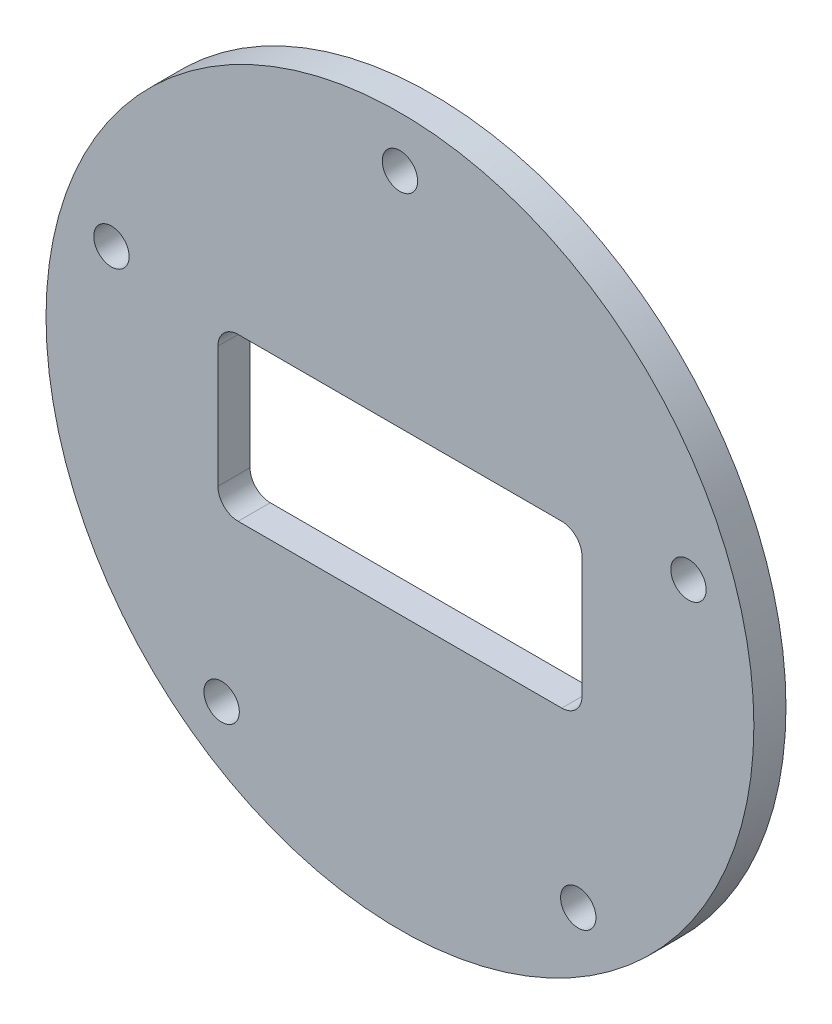
ISO-10303-21;
HEADER;
FILE_DESCRIPTION(('STEP AP214'),'2;1');
FILE_NAME('part.step','',(''),(''),'','','');
FILE_SCHEMA(('AUTOMOTIVE_DESIGN { 1 0 10303 214 1 1 1 1 }'));
ENDSEC;
DATA;
#1=APPLICATION_CONTEXT('core data for automotive mechanical design processes');
#2=APPLICATION_PROTOCOL_DEFINITION('international standard','automotive_design',2000,#1);
#3=PRODUCT_CONTEXT('',#1,'mechanical');
#4=PRODUCT('Part','Part','',(#3));
#5=PRODUCT_RELATED_PRODUCT_CATEGORY('part','',(#4));
#6=PRODUCT_DEFINITION_FORMATION('','',#4);
#7=PRODUCT_DEFINITION_CONTEXT('part definition',#1,'design');
#8=PRODUCT_DEFINITION('design','',#6,#7);
#9=PRODUCT_DEFINITION_SHAPE('','',#8);
#10=(LENGTH_UNIT() NAMED_UNIT(*) SI_UNIT(.MILLI.,.METRE.));
#11=(NAMED_UNIT(*) PLANE_ANGLE_UNIT() SI_UNIT($,.RADIAN.));
#12=(NAMED_UNIT(*) SI_UNIT($,.STERADIAN.) SOLID_ANGLE_UNIT());
#13=UNCERTAINTY_MEASURE_WITH_UNIT(LENGTH_MEASURE(1.E-05),#10,'distance_accuracy_value','');
#14=(GEOMETRIC_REPRESENTATION_CONTEXT(3) GLOBAL_UNCERTAINTY_ASSIGNED_CONTEXT((#13)) GLOBAL_UNIT_ASSIGNED_CONTEXT((#10,
#11,#12)) REPRESENTATION_CONTEXT('',''));
#15=CARTESIAN_POINT('',(0.,0.,0.));
#16=DIRECTION('',(0.,0.,1.));
#17=DIRECTION('',(1.,0.,0.));
#18=AXIS2_PLACEMENT_3D('',#15,#16,#17);
#19=CARTESIAN_POINT('',(0.,0.,3.175));
#20=DIRECTION('',(0.,0.,1.));
#21=DIRECTION('',(1.,0.,0.));
#22=AXIS2_PLACEMENT_3D('',#19,#20,#21);
#23=PLANE('',#22);
#24=CARTESIAN_POINT('',(-17.6335575687719,-24.2705098312492,3.175));
#25=DIRECTION('',(0.,0.,1.));
#26=DIRECTION('',(1.,0.,0.));
#27=AXIS2_PLACEMENT_3D('',#24,#25,#26);
#28=CIRCLE('',#27,1.75000000000268);
#29=CARTESIAN_POINT('',(-15.8835575687692,-24.2705098312492,3.175));
#30=VERTEX_POINT('',#29);
#31=EDGE_CURVE('E320',#30,#30,#28,.T.);
#32=ORIENTED_EDGE('',*,*,#31,.F.);
#33=EDGE_LOOP('',(#32));
#34=FACE_BOUND('',#33,.T.);
#35=CARTESIAN_POINT('',(28.5316954888555,9.27050983124964,3.175));
#36=DIRECTION('',(0.,0.,1.));
#37=DIRECTION('',(1.,0.,0.));
#38=AXIS2_PLACEMENT_3D('',#35,#36,#37);
#39=CIRCLE('',#38,1.75000000000057);
#40=CARTESIAN_POINT('',(30.2816954888561,9.27050983124964,3.175));
#41=VERTEX_POINT('',#40);
#42=EDGE_CURVE('E332',#41,#41,#39,.T.);
#43=ORIENTED_EDGE('',*,*,#42,.F.);
#44=EDGE_LOOP('',(#43));
#45=FACE_BOUND('',#44,.T.);
#46=DIRECTION('',(-1.,0.,0.));
#47=VECTOR('',#46,1.);
#48=CARTESIAN_POINT('',(16.,8.,3.175));
#49=LINE('',#48,#47);
#50=CARTESIAN_POINT('',(16.,8.,3.175));
#51=VERTEX_POINT('',#50);
#52=CARTESIAN_POINT('',(-16.,7.99999999999999,3.175));
#53=VERTEX_POINT('',#52);
#54=EDGE_CURVE('E106',#51,#53,#49,.T.);
#55=ORIENTED_EDGE('',*,*,#54,.F.);
#56=CARTESIAN_POINT('',(16.,6.,3.175));
#57=DIRECTION('',(0.,0.,1.));
#58=DIRECTION('',(1.,0.,0.));
#59=AXIS2_PLACEMENT_3D('',#56,#57,#58);
#60=CIRCLE('',#59,2.);
#61=CARTESIAN_POINT('',(18.,6.,3.175));
#62=VERTEX_POINT('',#61);
#63=EDGE_CURVE('E98',#62,#51,#60,.T.);
#64=ORIENTED_EDGE('',*,*,#63,.F.);
#65=DIRECTION('',(0.,1.,0.));
#66=VECTOR('',#65,1.);
#67=CARTESIAN_POINT('',(18.,-6.,3.175));
#68=LINE('',#67,#66);
#69=CARTESIAN_POINT('',(18.,-6.,3.175));
#70=VERTEX_POINT('',#69);
#71=EDGE_CURVE('E132',#70,#62,#68,.T.);
#72=ORIENTED_EDGE('',*,*,#71,.F.);
#73=CARTESIAN_POINT('',(16.,-6.,3.175));
#74=DIRECTION('',(0.,0.,1.));
#75=DIRECTION('',(1.,0.,0.));
#76=AXIS2_PLACEMENT_3D('',#73,#74,#75);
#77=CIRCLE('',#76,2.);
#78=CARTESIAN_POINT('',(16.,-8.,3.175));
#79=VERTEX_POINT('',#78);
#80=EDGE_CURVE('E130',#79,#70,#77,.T.);
#81=ORIENTED_EDGE('',*,*,#80,.F.);
#82=DIRECTION('',(1.,0.,0.));
#83=VECTOR('',#82,1.);
#84=CARTESIAN_POINT('',(16.,-8.,3.175));
#85=LINE('',#84,#83);
#86=CARTESIAN_POINT('',(-16.,-8.,3.175));
#87=VERTEX_POINT('',#86);
#88=EDGE_CURVE('E128',#87,#79,#85,.T.);
#89=ORIENTED_EDGE('',*,*,#88,.F.);
#90=CARTESIAN_POINT('',(-16.,-6.,3.175));
#91=DIRECTION('',(0.,0.,1.));
#92=DIRECTION('',(1.,0.,0.));
#93=AXIS2_PLACEMENT_3D('',#90,#91,#92);
#94=CIRCLE('',#93,2.);
#95=CARTESIAN_POINT('',(-18.,-6.,3.175));
#96=VERTEX_POINT('',#95);
#97=EDGE_CURVE('E126',#96,#87,#94,.T.);
#98=ORIENTED_EDGE('',*,*,#97,.F.);
#99=DIRECTION('',(0.,-1.,0.));
#100=VECTOR('',#99,1.);
#101=CARTESIAN_POINT('',(-18.,-6.,3.175));
#102=LINE('',#101,#100);
#103=CARTESIAN_POINT('',(-18.,6.,3.175));
#104=VERTEX_POINT('',#103);
#105=EDGE_CURVE('E121',#104,#96,#102,.T.);
#106=ORIENTED_EDGE('',*,*,#105,.F.);
#107=CARTESIAN_POINT('',(-16.,6.,3.175));
#108=DIRECTION('',(0.,0.,1.));
#109=DIRECTION('',(1.,0.,0.));
#110=AXIS2_PLACEMENT_3D('',#107,#108,#109);
#111=CIRCLE('',#110,2.);
#112=EDGE_CURVE('E119',#53,#104,#111,.T.);
#113=ORIENTED_EDGE('',*,*,#112,.F.);
#114=EDGE_LOOP('',(#55,#64,#72,#81,#89,#98,#106,#113));
#115=FACE_BOUND('',#114,.T.);
#116=CARTESIAN_POINT('',(0.,0.,3.175));
#117=DIRECTION('',(0.,0.,1.));
#118=DIRECTION('',(1.,0.,0.));
#119=AXIS2_PLACEMENT_3D('',#116,#117,#118);
#120=CIRCLE('',#119,35.);
#121=CARTESIAN_POINT('',(35.,0.,3.175));
#122=VERTEX_POINT('',#121);
#123=EDGE_CURVE('E11',#122,#122,#120,.T.);
#124=ORIENTED_EDGE('',*,*,#123,.T.);
#125=EDGE_LOOP('',(#124));
#126=FACE_BOUND('',#125,.T.);
#127=CARTESIAN_POINT('',(0.,30.,3.175));
#128=DIRECTION('',(0.,0.,1.));
#129=DIRECTION('',(1.,0.,0.));
#130=AXIS2_PLACEMENT_3D('',#127,#128,#129);
#131=CIRCLE('',#130,1.75);
#132=CARTESIAN_POINT('',(1.75,30.,3.175));
#133=VERTEX_POINT('',#132);
#134=EDGE_CURVE('E135',#133,#133,#131,.T.);
#135=ORIENTED_EDGE('',*,*,#134,.F.);
#136=EDGE_LOOP('',(#135));
#137=FACE_BOUND('',#136,.T.);
#138=CARTESIAN_POINT('',(17.6335575687765,-24.2705098312477,3.175));
#139=DIRECTION('',(0.,0.,1.));
#140=DIRECTION('',(1.,0.,0.));
#141=AXIS2_PLACEMENT_3D('',#138,#139,#140);
#142=CIRCLE('',#141,1.75000000000215);
#143=CARTESIAN_POINT('',(19.3835575687787,-24.2705098312477,3.175));
#144=VERTEX_POINT('',#143);
#145=EDGE_CURVE('E326',#144,#144,#142,.T.);
#146=ORIENTED_EDGE('',*,*,#145,.F.);
#147=EDGE_LOOP('',(#146));
#148=FACE_BOUND('',#147,.T.);
#149=CARTESIAN_POINT('',(-28.5316954888537,9.27050983124721,3.175));
#150=DIRECTION('',(0.,0.,1.));
#151=DIRECTION('',(1.,0.,0.));
#152=AXIS2_PLACEMENT_3D('',#149,#150,#151);
#153=CIRCLE('',#152,1.75000000000153);
#154=CARTESIAN_POINT('',(-26.7816954888522,9.27050983124721,3.175));
#155=VERTEX_POINT('',#154);
#156=EDGE_CURVE('E311',#155,#155,#153,.T.);
#157=ORIENTED_EDGE('',*,*,#156,.F.);
#158=EDGE_LOOP('',(#157));
#159=FACE_BOUND('',#158,.T.);
#160=ADVANCED_FACE('F33',(#34,#45,#115,#126,#137,#148,#159),#23,.T.);
#161=CARTESIAN_POINT('',(0.,0.,0.));
#162=DIRECTION('',(0.,0.,1.));
#163=DIRECTION('',(1.,0.,0.));
#164=AXIS2_PLACEMENT_3D('',#161,#162,#163);
#165=PLANE('',#164);
#166=CARTESIAN_POINT('',(-17.6335575687719,-24.2705098312492,0.));
#167=DIRECTION('',(0.,0.,1.));
#168=DIRECTION('',(1.,0.,0.));
#169=AXIS2_PLACEMENT_3D('',#166,#167,#168);
#170=CIRCLE('',#169,1.75000000000268);
#171=CARTESIAN_POINT('',(-15.8835575687692,-24.2705098312492,0.));
#172=VERTEX_POINT('',#171);
#173=EDGE_CURVE('E317',#172,#172,#170,.T.);
#174=ORIENTED_EDGE('',*,*,#173,.T.);
#175=EDGE_LOOP('',(#174));
#176=FACE_BOUND('',#175,.T.);
#177=CARTESIAN_POINT('',(28.5316954888555,9.27050983124964,0.));
#178=DIRECTION('',(0.,0.,1.));
#179=DIRECTION('',(1.,0.,0.));
#180=AXIS2_PLACEMENT_3D('',#177,#178,#179);
#181=CIRCLE('',#180,1.75000000000057);
#182=CARTESIAN_POINT('',(30.2816954888561,9.27050983124964,0.));
#183=VERTEX_POINT('',#182);
#184=EDGE_CURVE('E329',#183,#183,#181,.T.);
#185=ORIENTED_EDGE('',*,*,#184,.T.);
#186=EDGE_LOOP('',(#185));
#187=FACE_BOUND('',#186,.T.);
#188=CARTESIAN_POINT('',(16.,6.,0.));
#189=DIRECTION('',(0.,0.,1.));
#190=DIRECTION('',(1.,0.,0.));
#191=AXIS2_PLACEMENT_3D('',#188,#189,#190);
#192=CIRCLE('',#191,2.);
#193=CARTESIAN_POINT('',(18.,6.,0.));
#194=VERTEX_POINT('',#193);
#195=CARTESIAN_POINT('',(16.,8.,0.));
#196=VERTEX_POINT('',#195);
#197=EDGE_CURVE('E56',#194,#196,#192,.T.);
#198=ORIENTED_EDGE('',*,*,#197,.T.);
#199=DIRECTION('',(-1.,0.,0.));
#200=VECTOR('',#199,1.);
#201=CARTESIAN_POINT('',(16.,8.,0.));
#202=LINE('',#201,#200);
#203=CARTESIAN_POINT('',(-16.,7.99999999999999,0.));
#204=VERTEX_POINT('',#203);
#205=EDGE_CURVE('E113',#196,#204,#202,.T.);
#206=ORIENTED_EDGE('',*,*,#205,.T.);
#207=CARTESIAN_POINT('',(-16.,6.,0.));
#208=DIRECTION('',(0.,0.,1.));
#209=DIRECTION('',(1.,0.,0.));
#210=AXIS2_PLACEMENT_3D('',#207,#208,#209);
#211=CIRCLE('',#210,2.);
#212=CARTESIAN_POINT('',(-18.,6.,0.));
#213=VERTEX_POINT('',#212);
#214=EDGE_CURVE('E137',#204,#213,#211,.T.);
#215=ORIENTED_EDGE('',*,*,#214,.T.);
#216=DIRECTION('',(0.,-1.,0.));
#217=VECTOR('',#216,1.);
#218=CARTESIAN_POINT('',(-18.,-6.,0.));
#219=LINE('',#218,#217);
#220=CARTESIAN_POINT('',(-18.,-6.,0.));
#221=VERTEX_POINT('',#220);
#222=EDGE_CURVE('E140',#213,#221,#219,.T.);
#223=ORIENTED_EDGE('',*,*,#222,.T.);
#224=CARTESIAN_POINT('',(-16.,-6.,0.));
#225=DIRECTION('',(0.,0.,1.));
#226=DIRECTION('',(1.,0.,0.));
#227=AXIS2_PLACEMENT_3D('',#224,#225,#226);
#228=CIRCLE('',#227,2.);
#229=CARTESIAN_POINT('',(-16.,-8.,0.));
#230=VERTEX_POINT('',#229);
#231=EDGE_CURVE('E143',#221,#230,#228,.T.);
#232=ORIENTED_EDGE('',*,*,#231,.T.);
#233=DIRECTION('',(1.,0.,0.));
#234=VECTOR('',#233,1.);
#235=CARTESIAN_POINT('',(16.,-8.,0.));
#236=LINE('',#235,#234);
#237=CARTESIAN_POINT('',(16.,-8.,0.));
#238=VERTEX_POINT('',#237);
#239=EDGE_CURVE('E146',#230,#238,#236,.T.);
#240=ORIENTED_EDGE('',*,*,#239,.T.);
#241=CARTESIAN_POINT('',(16.,-6.,0.));
#242=DIRECTION('',(0.,0.,1.));
#243=DIRECTION('',(1.,0.,0.));
#244=AXIS2_PLACEMENT_3D('',#241,#242,#243);
#245=CIRCLE('',#244,2.);
#246=CARTESIAN_POINT('',(18.,-6.,0.));
#247=VERTEX_POINT('',#246);
#248=EDGE_CURVE('E149',#238,#247,#245,.T.);
#249=ORIENTED_EDGE('',*,*,#248,.T.);
#250=DIRECTION('',(0.,1.,0.));
#251=VECTOR('',#250,1.);
#252=CARTESIAN_POINT('',(18.,-6.,0.));
#253=LINE('',#252,#251);
#254=EDGE_CURVE('E107',#247,#194,#253,.T.);
#255=ORIENTED_EDGE('',*,*,#254,.T.);
#256=EDGE_LOOP('',(#198,#206,#215,#223,#232,#240,#249,#255));
#257=FACE_BOUND('',#256,.T.);
#258=CARTESIAN_POINT('',(0.,0.,0.));
#259=DIRECTION('',(0.,0.,1.));
#260=DIRECTION('',(1.,0.,0.));
#261=AXIS2_PLACEMENT_3D('',#258,#259,#260);
#262=CIRCLE('',#261,35.);
#263=CARTESIAN_POINT('',(35.,0.,0.));
#264=VERTEX_POINT('',#263);
#265=EDGE_CURVE('E37',#264,#264,#262,.T.);
#266=ORIENTED_EDGE('',*,*,#265,.F.);
#267=EDGE_LOOP('',(#266));
#268=FACE_BOUND('',#267,.T.);
#269=CARTESIAN_POINT('',(0.,30.,0.));
#270=DIRECTION('',(0.,0.,1.));
#271=DIRECTION('',(1.,0.,0.));
#272=AXIS2_PLACEMENT_3D('',#269,#270,#271);
#273=CIRCLE('',#272,1.75);
#274=CARTESIAN_POINT('',(1.75,30.,0.));
#275=VERTEX_POINT('',#274);
#276=EDGE_CURVE('E335',#275,#275,#273,.T.);
#277=ORIENTED_EDGE('',*,*,#276,.T.);
#278=EDGE_LOOP('',(#277));
#279=FACE_BOUND('',#278,.T.);
#280=CARTESIAN_POINT('',(17.6335575687765,-24.2705098312477,0.));
#281=DIRECTION('',(0.,0.,1.));
#282=DIRECTION('',(1.,0.,0.));
#283=AXIS2_PLACEMENT_3D('',#280,#281,#282);
#284=CIRCLE('',#283,1.75000000000215);
#285=CARTESIAN_POINT('',(19.3835575687787,-24.2705098312477,0.));
#286=VERTEX_POINT('',#285);
#287=EDGE_CURVE('E323',#286,#286,#284,.T.);
#288=ORIENTED_EDGE('',*,*,#287,.T.);
#289=EDGE_LOOP('',(#288));
#290=FACE_BOUND('',#289,.T.);
#291=CARTESIAN_POINT('',(-28.5316954888537,9.27050983124721,0.));
#292=DIRECTION('',(0.,0.,1.));
#293=DIRECTION('',(1.,0.,0.));
#294=AXIS2_PLACEMENT_3D('',#291,#292,#293);
#295=CIRCLE('',#294,1.75000000000153);
#296=CARTESIAN_POINT('',(-26.7816954888522,9.27050983124721,0.));
#297=VERTEX_POINT('',#296);
#298=EDGE_CURVE('E314',#297,#297,#295,.T.);
#299=ORIENTED_EDGE('',*,*,#298,.T.);
#300=EDGE_LOOP('',(#299));
#301=FACE_BOUND('',#300,.T.);
#302=ADVANCED_FACE('F170',(#176,#187,#257,#268,#279,#290,#301),#165,.F.);
#303=CARTESIAN_POINT('',(0.,0.,3.175));
#304=DIRECTION('',(0.,0.,-1.));
#305=DIRECTION('',(-1.,0.,0.));
#306=AXIS2_PLACEMENT_3D('',#303,#304,#305);
#307=CYLINDRICAL_SURFACE('',#306,35.);
#308=ORIENTED_EDGE('',*,*,#123,.F.);
#309=EDGE_LOOP('',(#308));
#310=FACE_BOUND('',#309,.T.);
#311=ORIENTED_EDGE('',*,*,#265,.T.);
#312=EDGE_LOOP('',(#311));
#313=FACE_BOUND('',#312,.T.);
#314=ADVANCED_FACE('F35',(#310,#313),#307,.T.);
#315=CARTESIAN_POINT('',(16.,6.,3.175));
#316=DIRECTION('',(0.,0.,-1.));
#317=DIRECTION('',(-1.,0.,0.));
#318=AXIS2_PLACEMENT_3D('',#315,#316,#317);
#319=CYLINDRICAL_SURFACE('',#318,2.);
#320=ORIENTED_EDGE('',*,*,#197,.F.);
#321=DIRECTION('',(0.,0.,-1.));
#322=VECTOR('',#321,1.);
#323=CARTESIAN_POINT('',(18.,6.,3.175));
#324=LINE('',#323,#322);
#325=EDGE_CURVE('E102',#62,#194,#324,.T.);
#326=ORIENTED_EDGE('',*,*,#325,.F.);
#327=ORIENTED_EDGE('',*,*,#63,.T.);
#328=DIRECTION('',(0.,0.,-1.));
#329=VECTOR('',#328,1.);
#330=CARTESIAN_POINT('',(16.,8.,3.175));
#331=LINE('',#330,#329);
#332=EDGE_CURVE('E101',#51,#196,#331,.T.);
#333=ORIENTED_EDGE('',*,*,#332,.T.);
#334=EDGE_LOOP('',(#320,#326,#327,#333));
#335=FACE_BOUND('',#334,.T.);
#336=ADVANCED_FACE('F100',(#335),#319,.F.);
#337=CARTESIAN_POINT('',(16.,8.,3.175));
#338=DIRECTION('',(0.,-1.,0.));
#339=DIRECTION('',(1.,0.,0.));
#340=AXIS2_PLACEMENT_3D('',#337,#338,#339);
#341=PLANE('',#340);
#342=ORIENTED_EDGE('',*,*,#205,.F.);
#343=ORIENTED_EDGE('',*,*,#332,.F.);
#344=ORIENTED_EDGE('',*,*,#54,.T.);
#345=DIRECTION('',(0.,0.,-1.));
#346=VECTOR('',#345,1.);
#347=CARTESIAN_POINT('',(-16.,7.99999999999999,3.175));
#348=LINE('',#347,#346);
#349=EDGE_CURVE('E114',#53,#204,#348,.T.);
#350=ORIENTED_EDGE('',*,*,#349,.T.);
#351=EDGE_LOOP('',(#342,#343,#344,#350));
#352=FACE_BOUND('',#351,.T.);
#353=ADVANCED_FACE('F110',(#352),#341,.T.);
#354=CARTESIAN_POINT('',(-16.,6.,3.175));
#355=DIRECTION('',(0.,0.,-1.));
#356=DIRECTION('',(-1.,0.,0.));
#357=AXIS2_PLACEMENT_3D('',#354,#355,#356);
#358=CYLINDRICAL_SURFACE('',#357,2.);
#359=ORIENTED_EDGE('',*,*,#214,.F.);
#360=ORIENTED_EDGE('',*,*,#349,.F.);
#361=ORIENTED_EDGE('',*,*,#112,.T.);
#362=DIRECTION('',(0.,0.,-1.));
#363=VECTOR('',#362,1.);
#364=CARTESIAN_POINT('',(-18.,6.,3.175));
#365=LINE('',#364,#363);
#366=EDGE_CURVE('E162',#104,#213,#365,.T.);
#367=ORIENTED_EDGE('',*,*,#366,.T.);
#368=EDGE_LOOP('',(#359,#360,#361,#367));
#369=FACE_BOUND('',#368,.T.);
#370=ADVANCED_FACE('F166',(#369),#358,.F.);
#371=CARTESIAN_POINT('',(-18.,-6.,3.175));
#372=DIRECTION('',(1.,0.,0.));
#373=DIRECTION('',(0.,0.,-1.));
#374=AXIS2_PLACEMENT_3D('',#371,#372,#373);
#375=PLANE('',#374);
#376=ORIENTED_EDGE('',*,*,#222,.F.);
#377=ORIENTED_EDGE('',*,*,#366,.F.);
#378=ORIENTED_EDGE('',*,*,#105,.T.);
#379=DIRECTION('',(0.,0.,-1.));
#380=VECTOR('',#379,1.);
#381=CARTESIAN_POINT('',(-18.,-6.,3.175));
#382=LINE('',#381,#380);
#383=EDGE_CURVE('E160',#96,#221,#382,.T.);
#384=ORIENTED_EDGE('',*,*,#383,.T.);
#385=EDGE_LOOP('',(#376,#377,#378,#384));
#386=FACE_BOUND('',#385,.T.);
#387=ADVANCED_FACE('F189',(#386),#375,.T.);
#388=CARTESIAN_POINT('',(-16.,-6.,3.175));
#389=DIRECTION('',(0.,0.,-1.));
#390=DIRECTION('',(-1.,0.,0.));
#391=AXIS2_PLACEMENT_3D('',#388,#389,#390);
#392=CYLINDRICAL_SURFACE('',#391,2.);
#393=ORIENTED_EDGE('',*,*,#231,.F.);
#394=ORIENTED_EDGE('',*,*,#383,.F.);
#395=ORIENTED_EDGE('',*,*,#97,.T.);
#396=DIRECTION('',(0.,0.,-1.));
#397=VECTOR('',#396,1.);
#398=CARTESIAN_POINT('',(-16.,-8.,3.175));
#399=LINE('',#398,#397);
#400=EDGE_CURVE('E158',#87,#230,#399,.T.);
#401=ORIENTED_EDGE('',*,*,#400,.T.);
#402=EDGE_LOOP('',(#393,#394,#395,#401));
#403=FACE_BOUND('',#402,.T.);
#404=ADVANCED_FACE('F186',(#403),#392,.F.);
#405=CARTESIAN_POINT('',(16.,-8.,3.175));
#406=DIRECTION('',(0.,1.,0.));
#407=DIRECTION('',(0.,0.,1.));
#408=AXIS2_PLACEMENT_3D('',#405,#406,#407);
#409=PLANE('',#408);
#410=ORIENTED_EDGE('',*,*,#239,.F.);
#411=ORIENTED_EDGE('',*,*,#400,.F.);
#412=ORIENTED_EDGE('',*,*,#88,.T.);
#413=DIRECTION('',(0.,0.,-1.));
#414=VECTOR('',#413,1.);
#415=CARTESIAN_POINT('',(16.,-8.,3.175));
#416=LINE('',#415,#414);
#417=EDGE_CURVE('E156',#79,#238,#416,.T.);
#418=ORIENTED_EDGE('',*,*,#417,.T.);
#419=EDGE_LOOP('',(#410,#411,#412,#418));
#420=FACE_BOUND('',#419,.T.);
#421=ADVANCED_FACE('F182',(#420),#409,.T.);
#422=CARTESIAN_POINT('',(16.,-6.,3.175));
#423=DIRECTION('',(0.,0.,-1.));
#424=DIRECTION('',(-1.,0.,0.));
#425=AXIS2_PLACEMENT_3D('',#422,#423,#424);
#426=CYLINDRICAL_SURFACE('',#425,2.);
#427=ORIENTED_EDGE('',*,*,#248,.F.);
#428=ORIENTED_EDGE('',*,*,#417,.F.);
#429=ORIENTED_EDGE('',*,*,#80,.T.);
#430=DIRECTION('',(0.,0.,-1.));
#431=VECTOR('',#430,1.);
#432=CARTESIAN_POINT('',(18.,-6.,3.175));
#433=LINE('',#432,#431);
#434=EDGE_CURVE('E48',#70,#247,#433,.T.);
#435=ORIENTED_EDGE('',*,*,#434,.T.);
#436=EDGE_LOOP('',(#427,#428,#429,#435));
#437=FACE_BOUND('',#436,.T.);
#438=ADVANCED_FACE('F179',(#437),#426,.F.);
#439=CARTESIAN_POINT('',(18.,-6.,3.175));
#440=DIRECTION('',(-1.,0.,0.));
#441=DIRECTION('',(0.,0.,1.));
#442=AXIS2_PLACEMENT_3D('',#439,#440,#441);
#443=PLANE('',#442);
#444=ORIENTED_EDGE('',*,*,#254,.F.);
#445=ORIENTED_EDGE('',*,*,#434,.F.);
#446=ORIENTED_EDGE('',*,*,#71,.T.);
#447=ORIENTED_EDGE('',*,*,#325,.T.);
#448=EDGE_LOOP('',(#444,#445,#446,#447));
#449=FACE_BOUND('',#448,.T.);
#450=ADVANCED_FACE('F173',(#449),#443,.T.);
#451=CARTESIAN_POINT('',(0.,30.,3.175));
#452=DIRECTION('',(0.,0.,-1.));
#453=DIRECTION('',(-1.,0.,0.));
#454=AXIS2_PLACEMENT_3D('',#451,#452,#453);
#455=CYLINDRICAL_SURFACE('',#454,1.75);
#456=ORIENTED_EDGE('',*,*,#134,.T.);
#457=EDGE_LOOP('',(#456));
#458=FACE_BOUND('',#457,.T.);
#459=ORIENTED_EDGE('',*,*,#276,.F.);
#460=EDGE_LOOP('',(#459));
#461=FACE_BOUND('',#460,.T.);
#462=ADVANCED_FACE('F255',(#458,#461),#455,.F.);
#463=CARTESIAN_POINT('',(28.5316954888555,9.27050983124964,3.175));
#464=DIRECTION('',(0.,0.,-1.));
#465=DIRECTION('',(-1.,0.,0.));
#466=AXIS2_PLACEMENT_3D('',#463,#464,#465);
#467=CYLINDRICAL_SURFACE('',#466,1.75000000000057);
#468=ORIENTED_EDGE('',*,*,#42,.T.);
#469=EDGE_LOOP('',(#468));
#470=FACE_BOUND('',#469,.T.);
#471=ORIENTED_EDGE('',*,*,#184,.F.);
#472=EDGE_LOOP('',(#471));
#473=FACE_BOUND('',#472,.T.);
#474=ADVANCED_FACE('F264',(#470,#473),#467,.F.);
#475=CARTESIAN_POINT('',(17.6335575687765,-24.2705098312477,3.175));
#476=DIRECTION('',(0.,0.,-1.));
#477=DIRECTION('',(-1.,0.,0.));
#478=AXIS2_PLACEMENT_3D('',#475,#476,#477);
#479=CYLINDRICAL_SURFACE('',#478,1.75000000000215);
#480=ORIENTED_EDGE('',*,*,#145,.T.);
#481=EDGE_LOOP('',(#480));
#482=FACE_BOUND('',#481,.T.);
#483=ORIENTED_EDGE('',*,*,#287,.F.);
#484=EDGE_LOOP('',(#483));
#485=FACE_BOUND('',#484,.T.);
#486=ADVANCED_FACE('F274',(#482,#485),#479,.F.);
#487=CARTESIAN_POINT('',(-17.6335575687719,-24.2705098312492,3.175));
#488=DIRECTION('',(0.,0.,-1.));
#489=DIRECTION('',(-1.,0.,0.));
#490=AXIS2_PLACEMENT_3D('',#487,#488,#489);
#491=CYLINDRICAL_SURFACE('',#490,1.75000000000268);
#492=ORIENTED_EDGE('',*,*,#31,.T.);
#493=EDGE_LOOP('',(#492));
#494=FACE_BOUND('',#493,.T.);
#495=ORIENTED_EDGE('',*,*,#173,.F.);
#496=EDGE_LOOP('',(#495));
#497=FACE_BOUND('',#496,.T.);
#498=ADVANCED_FACE('F284',(#494,#497),#491,.F.);
#499=CARTESIAN_POINT('',(-28.5316954888537,9.27050983124721,3.175));
#500=DIRECTION('',(0.,0.,-1.));
#501=DIRECTION('',(-1.,0.,0.));
#502=AXIS2_PLACEMENT_3D('',#499,#500,#501);
#503=CYLINDRICAL_SURFACE('',#502,1.75000000000153);
#504=ORIENTED_EDGE('',*,*,#156,.T.);
#505=EDGE_LOOP('',(#504));
#506=FACE_BOUND('',#505,.T.);
#507=ORIENTED_EDGE('',*,*,#298,.F.);
#508=EDGE_LOOP('',(#507));
#509=FACE_BOUND('',#508,.T.);
#510=ADVANCED_FACE('F294',(#506,#509),#503,.F.);
#511=CLOSED_SHELL('',(#160,#302,#314,#336,#353,#370,#387,#404,#421,#438,#450,#462,#474,#486,
#498,#510));
#512=MANIFOLD_SOLID_BREP('B2',#511);
#513=ADVANCED_BREP_SHAPE_REPRESENTATION('',(#18,#512),#14);
#514=SHAPE_DEFINITION_REPRESENTATION(#9,#513);
ENDSEC;
END-ISO-10303-21;
